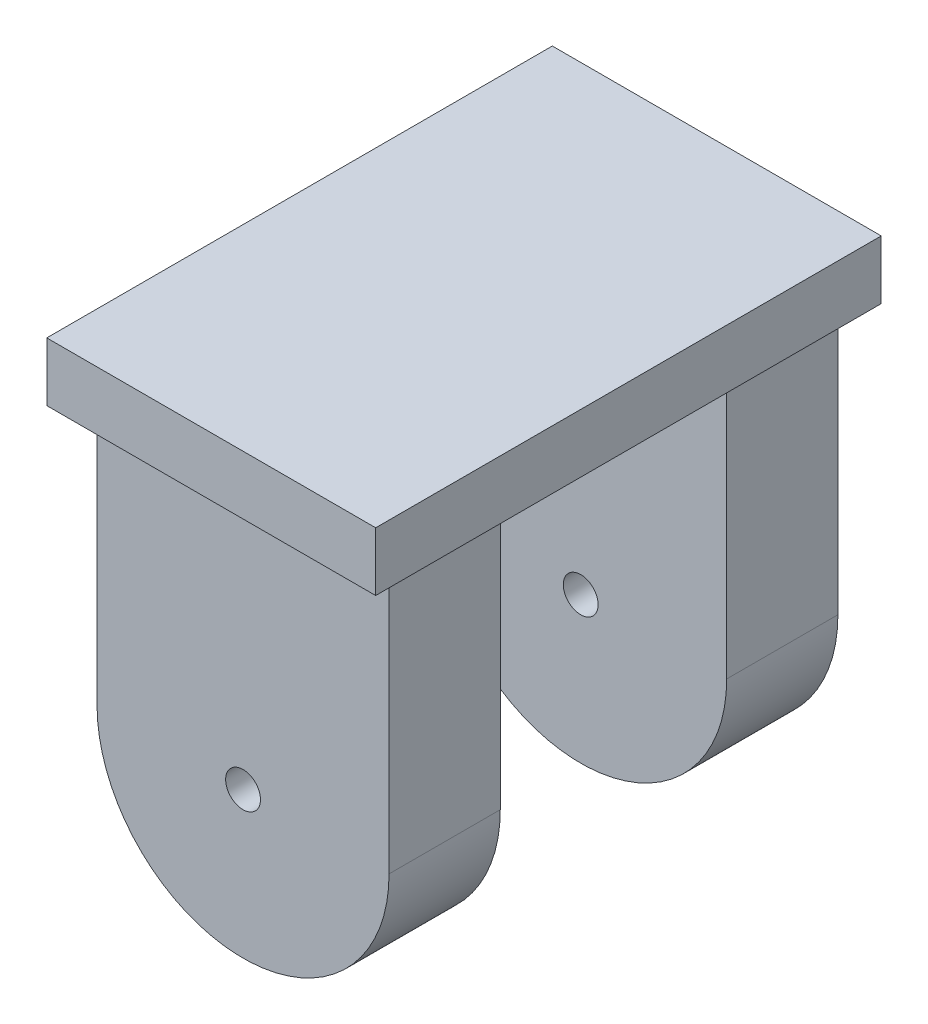
ISO-10303-21;
HEADER;
FILE_DESCRIPTION(('STEP AP214'),'2;1');
FILE_NAME('part.step','',(''),(''),'','','');
FILE_SCHEMA(('AUTOMOTIVE_DESIGN { 1 0 10303 214 1 1 1 1 }'));
ENDSEC;
DATA;
#1=APPLICATION_CONTEXT('core data for automotive mechanical design processes');
#2=APPLICATION_PROTOCOL_DEFINITION('international standard','automotive_design',2000,#1);
#3=PRODUCT_CONTEXT('',#1,'mechanical');
#4=PRODUCT('Part','Part','',(#3));
#5=PRODUCT_RELATED_PRODUCT_CATEGORY('part','',(#4));
#6=PRODUCT_DEFINITION_FORMATION('','',#4);
#7=PRODUCT_DEFINITION_CONTEXT('part definition',#1,'design');
#8=PRODUCT_DEFINITION('design','',#6,#7);
#9=PRODUCT_DEFINITION_SHAPE('','',#8);
#10=(LENGTH_UNIT() NAMED_UNIT(*) SI_UNIT(.MILLI.,.METRE.));
#11=(NAMED_UNIT(*) PLANE_ANGLE_UNIT() SI_UNIT($,.RADIAN.));
#12=(NAMED_UNIT(*) SI_UNIT($,.STERADIAN.) SOLID_ANGLE_UNIT());
#13=UNCERTAINTY_MEASURE_WITH_UNIT(LENGTH_MEASURE(1.E-05),#10,'distance_accuracy_value','');
#14=(GEOMETRIC_REPRESENTATION_CONTEXT(3) GLOBAL_UNCERTAINTY_ASSIGNED_CONTEXT((#13)) GLOBAL_UNIT_ASSIGNED_CONTEXT((#10,
#11,#12)) REPRESENTATION_CONTEXT('',''));
#15=CARTESIAN_POINT('',(0.,0.,0.));
#16=DIRECTION('',(0.,0.,1.));
#17=DIRECTION('',(1.,0.,0.));
#18=AXIS2_PLACEMENT_3D('',#15,#16,#17);
#19=CARTESIAN_POINT('',(20.4206380314162,31.4285452958827,64.4223527306653));
#20=DIRECTION('',(0.,0.,-1.));
#21=DIRECTION('',(-1.,0.,0.));
#22=AXIS2_PLACEMENT_3D('',#19,#20,#21);
#23=CYLINDRICAL_SURFACE('',#22,41.9130289227795);
#24=CARTESIAN_POINT('',(20.4206380314162,31.4285452958827,-32.5));
#25=DIRECTION('',(0.,0.,1.));
#26=DIRECTION('',(1.,0.,0.));
#27=AXIS2_PLACEMENT_3D('',#24,#25,#26);
#28=CIRCLE('',#27,41.9130289227795);
#29=CARTESIAN_POINT('',(-21.4923908913633,31.4285452958827,-32.5));
#30=VERTEX_POINT('',#29);
#31=CARTESIAN_POINT('',(62.3336669541957,31.4285452958827,-32.5));
#32=VERTEX_POINT('',#31);
#33=EDGE_CURVE('E253',#30,#32,#28,.T.);
#34=ORIENTED_EDGE('',*,*,#33,.F.);
#35=DIRECTION('',(0.,0.,-1.));
#36=VECTOR('',#35,1.);
#37=CARTESIAN_POINT('',(-21.4923908913633,31.4285452958827,64.4223527306653));
#38=LINE('',#37,#36);
#39=CARTESIAN_POINT('',(-21.4923908913633,31.4285452958827,-64.4223527306653));
#40=VERTEX_POINT('',#39);
#41=EDGE_CURVE('E89',#30,#40,#38,.T.);
#42=ORIENTED_EDGE('',*,*,#41,.T.);
#43=CARTESIAN_POINT('',(20.4206380314162,31.4285452958827,-64.4223527306653));
#44=DIRECTION('',(0.,0.,1.));
#45=DIRECTION('',(1.,0.,0.));
#46=AXIS2_PLACEMENT_3D('',#43,#44,#45);
#47=CIRCLE('',#46,41.9130289227795);
#48=CARTESIAN_POINT('',(62.3336669541957,31.4285452958827,-64.4223527306653));
#49=VERTEX_POINT('',#48);
#50=EDGE_CURVE('E190',#40,#49,#47,.T.);
#51=ORIENTED_EDGE('',*,*,#50,.T.);
#52=DIRECTION('',(0.,0.,-1.));
#53=VECTOR('',#52,1.);
#54=CARTESIAN_POINT('',(62.3336669541957,31.4285452958827,64.4223527306653));
#55=LINE('',#54,#53);
#56=EDGE_CURVE('E54',#32,#49,#55,.T.);
#57=ORIENTED_EDGE('',*,*,#56,.F.);
#58=EDGE_LOOP('',(#34,#42,#51,#57));
#59=FACE_BOUND('',#58,.T.);
#60=ADVANCED_FACE('F45',(#59),#23,.T.);
#61=CARTESIAN_POINT('',(62.3336669541957,31.4285452958827,64.4223527306653));
#62=DIRECTION('',(-1.,0.,0.));
#63=DIRECTION('',(0.,0.,1.));
#64=AXIS2_PLACEMENT_3D('',#61,#62,#63);
#65=PLANE('',#64);
#66=DIRECTION('',(0.,1.,0.));
#67=VECTOR('',#66,1.);
#68=CARTESIAN_POINT('',(62.3336669541957,31.4285452958827,-32.5));
#69=LINE('',#68,#67);
#70=CARTESIAN_POINT('',(62.3336669541956,107.442049888343,-32.5));
#71=VERTEX_POINT('',#70);
#72=EDGE_CURVE('E239',#32,#71,#69,.T.);
#73=ORIENTED_EDGE('',*,*,#72,.F.);
#74=ORIENTED_EDGE('',*,*,#56,.T.);
#75=DIRECTION('',(0.,1.,0.));
#76=VECTOR('',#75,1.);
#77=CARTESIAN_POINT('',(62.3336669541957,31.4285452958827,-64.4223527306653));
#78=LINE('',#77,#76);
#79=CARTESIAN_POINT('',(62.3336669541957,107.442049888343,-64.4223527306653));
#80=VERTEX_POINT('',#79);
#81=EDGE_CURVE('E186',#49,#80,#78,.T.);
#82=ORIENTED_EDGE('',*,*,#81,.T.);
#83=DIRECTION('',(0.,0.,-1.));
#84=VECTOR('',#83,1.);
#85=CARTESIAN_POINT('',(62.3336669541957,107.442049888343,64.4223527306653));
#86=LINE('',#85,#84);
#87=EDGE_CURVE('E166',#71,#80,#86,.T.);
#88=ORIENTED_EDGE('',*,*,#87,.F.);
#89=EDGE_LOOP('',(#73,#74,#82,#88));
#90=FACE_BOUND('',#89,.T.);
#91=ADVANCED_FACE('F291',(#90),#65,.F.);
#92=CARTESIAN_POINT('',(-21.4923908913633,31.4285452958827,64.4223527306653));
#93=DIRECTION('',(1.,0.,0.));
#94=DIRECTION('',(0.,0.,-1.));
#95=AXIS2_PLACEMENT_3D('',#92,#93,#94);
#96=PLANE('',#95);
#97=DIRECTION('',(0.,-1.,0.));
#98=VECTOR('',#97,1.);
#99=CARTESIAN_POINT('',(-21.4923908913633,31.4285452958827,-32.5));
#100=LINE('',#99,#98);
#101=CARTESIAN_POINT('',(-21.4923908913633,107.442049888343,-32.5));
#102=VERTEX_POINT('',#101);
#103=EDGE_CURVE('E256',#102,#30,#100,.T.);
#104=ORIENTED_EDGE('',*,*,#103,.F.);
#105=DIRECTION('',(0.,0.,-1.));
#106=VECTOR('',#105,1.);
#107=CARTESIAN_POINT('',(-21.4923908913633,107.442049888343,64.4223527306653));
#108=LINE('',#107,#106);
#109=CARTESIAN_POINT('',(-21.4923908913633,107.442049888343,-64.4223527306653));
#110=VERTEX_POINT('',#109);
#111=EDGE_CURVE('E173',#102,#110,#108,.T.);
#112=ORIENTED_EDGE('',*,*,#111,.T.);
#113=DIRECTION('',(0.,-1.,0.));
#114=VECTOR('',#113,1.);
#115=CARTESIAN_POINT('',(-21.4923908913633,31.4285452958827,-64.4223527306653));
#116=LINE('',#115,#114);
#117=EDGE_CURVE('E178',#110,#40,#116,.T.);
#118=ORIENTED_EDGE('',*,*,#117,.T.);
#119=ORIENTED_EDGE('',*,*,#41,.F.);
#120=EDGE_LOOP('',(#104,#112,#118,#119));
#121=FACE_BOUND('',#120,.T.);
#122=ADVANCED_FACE('F280',(#121),#96,.F.);
#123=CARTESIAN_POINT('',(20.4206380314162,31.4285452958827,64.4223527306653));
#124=DIRECTION('',(0.,0.,-1.));
#125=DIRECTION('',(-1.,0.,0.));
#126=AXIS2_PLACEMENT_3D('',#123,#124,#125);
#127=CYLINDRICAL_SURFACE('',#126,5.);
#128=CARTESIAN_POINT('',(20.4206380314162,31.4285452958827,-64.4223527306653));
#129=DIRECTION('',(0.,0.,1.));
#130=DIRECTION('',(1.,0.,0.));
#131=AXIS2_PLACEMENT_3D('',#128,#129,#130);
#132=CIRCLE('',#131,5.);
#133=CARTESIAN_POINT('',(25.4206380314162,31.4285452958827,-64.4223527306653));
#134=VERTEX_POINT('',#133);
#135=EDGE_CURVE('E202',#134,#134,#132,.T.);
#136=ORIENTED_EDGE('',*,*,#135,.F.);
#137=EDGE_LOOP('',(#136));
#138=FACE_BOUND('',#137,.T.);
#139=CARTESIAN_POINT('',(20.4206380314162,31.4285452958827,-32.5));
#140=DIRECTION('',(0.,0.,1.));
#141=DIRECTION('',(1.,0.,0.));
#142=AXIS2_PLACEMENT_3D('',#139,#140,#141);
#143=CIRCLE('',#142,5.);
#144=CARTESIAN_POINT('',(25.4206380314162,31.4285452958827,-32.5));
#145=VERTEX_POINT('',#144);
#146=EDGE_CURVE('E160',#145,#145,#143,.T.);
#147=ORIENTED_EDGE('',*,*,#146,.T.);
#148=EDGE_LOOP('',(#147));
#149=FACE_BOUND('',#148,.T.);
#150=ADVANCED_FACE('F319',(#138,#149),#127,.F.);
#151=CARTESIAN_POINT('',(20.4206380314162,31.4285452958827,64.4223527306653));
#152=DIRECTION('',(0.,0.,1.));
#153=DIRECTION('',(1.,0.,0.));
#154=AXIS2_PLACEMENT_3D('',#151,#152,#153);
#155=PLANE('',#154);
#156=CARTESIAN_POINT('',(20.4206380314162,31.4285452958827,64.4223527306653));
#157=DIRECTION('',(0.,0.,1.));
#158=DIRECTION('',(1.,0.,0.));
#159=AXIS2_PLACEMENT_3D('',#156,#157,#158);
#160=CIRCLE('',#159,41.9130289227795);
#161=CARTESIAN_POINT('',(-21.4923908913633,31.4285452958827,64.4223527306653));
#162=VERTEX_POINT('',#161);
#163=CARTESIAN_POINT('',(62.3336669541957,31.4285452958827,64.4223527306653));
#164=VERTEX_POINT('',#163);
#165=EDGE_CURVE('E181',#162,#164,#160,.T.);
#166=ORIENTED_EDGE('',*,*,#165,.T.);
#167=DIRECTION('',(0.,1.,0.));
#168=VECTOR('',#167,1.);
#169=CARTESIAN_POINT('',(62.3336669541957,31.4285452958827,64.4223527306653));
#170=LINE('',#169,#168);
#171=CARTESIAN_POINT('',(62.3336669541957,107.442049888343,64.4223527306653));
#172=VERTEX_POINT('',#171);
#173=EDGE_CURVE('E96',#164,#172,#170,.T.);
#174=ORIENTED_EDGE('',*,*,#173,.T.);
#175=DIRECTION('',(-1.,0.,0.));
#176=VECTOR('',#175,1.);
#177=CARTESIAN_POINT('',(-21.4923908913633,107.442049888343,64.4223527306653));
#178=LINE('',#177,#176);
#179=CARTESIAN_POINT('',(-21.4923908913633,107.442049888343,64.4223527306653));
#180=VERTEX_POINT('',#179);
#181=EDGE_CURVE('E164',#172,#180,#178,.T.);
#182=ORIENTED_EDGE('',*,*,#181,.T.);
#183=DIRECTION('',(0.,-1.,0.));
#184=VECTOR('',#183,1.);
#185=CARTESIAN_POINT('',(-21.4923908913633,31.4285452958827,64.4223527306653));
#186=LINE('',#185,#184);
#187=EDGE_CURVE('E70',#180,#162,#186,.T.);
#188=ORIENTED_EDGE('',*,*,#187,.T.);
#189=EDGE_LOOP('',(#166,#174,#182,#188));
#190=FACE_BOUND('',#189,.T.);
#191=CARTESIAN_POINT('',(20.4206380314162,31.4285452958827,64.4223527306653));
#192=DIRECTION('',(0.,0.,1.));
#193=DIRECTION('',(1.,0.,0.));
#194=AXIS2_PLACEMENT_3D('',#191,#192,#193);
#195=CIRCLE('',#194,5.);
#196=CARTESIAN_POINT('',(25.4206380314162,31.4285452958827,64.4223527306653));
#197=VERTEX_POINT('',#196);
#198=EDGE_CURVE('E193',#197,#197,#195,.T.);
#199=ORIENTED_EDGE('',*,*,#198,.F.);
#200=EDGE_LOOP('',(#199));
#201=FACE_BOUND('',#200,.T.);
#202=ADVANCED_FACE('F306',(#190,#201),#155,.T.);
#203=CARTESIAN_POINT('',(20.4206380314162,31.4285452958827,-64.4223527306653));
#204=DIRECTION('',(0.,0.,1.));
#205=DIRECTION('',(1.,0.,0.));
#206=AXIS2_PLACEMENT_3D('',#203,#204,#205);
#207=PLANE('',#206);
#208=ORIENTED_EDGE('',*,*,#50,.F.);
#209=ORIENTED_EDGE('',*,*,#117,.F.);
#210=DIRECTION('',(-1.,0.,0.));
#211=VECTOR('',#210,1.);
#212=CARTESIAN_POINT('',(-21.4923908913633,107.442049888343,-64.4223527306653));
#213=LINE('',#212,#211);
#214=EDGE_CURVE('E182',#80,#110,#213,.T.);
#215=ORIENTED_EDGE('',*,*,#214,.F.);
#216=ORIENTED_EDGE('',*,*,#81,.F.);
#217=EDGE_LOOP('',(#208,#209,#215,#216));
#218=FACE_BOUND('',#217,.T.);
#219=ORIENTED_EDGE('',*,*,#135,.T.);
#220=EDGE_LOOP('',(#219));
#221=FACE_BOUND('',#220,.T.);
#222=ADVANCED_FACE('F288',(#218,#221),#207,.F.);
#223=CARTESIAN_POINT('',(-21.4923908913633,31.4285452958827,32.5));
#224=VERTEX_POINT('',#223);
#225=EDGE_CURVE('E174',#162,#224,#38,.T.);
#226=ORIENTED_EDGE('',*,*,#225,.T.);
#227=CARTESIAN_POINT('',(20.4206380314162,31.4285452958827,32.5));
#228=DIRECTION('',(0.,0.,1.));
#229=DIRECTION('',(1.,0.,0.));
#230=AXIS2_PLACEMENT_3D('',#227,#228,#229);
#231=CIRCLE('',#230,41.9130289227795);
#232=CARTESIAN_POINT('',(62.3336669541957,31.4285452958827,32.5));
#233=VERTEX_POINT('',#232);
#234=EDGE_CURVE('E61',#224,#233,#231,.T.);
#235=ORIENTED_EDGE('',*,*,#234,.T.);
#236=EDGE_CURVE('E11',#164,#233,#55,.T.);
#237=ORIENTED_EDGE('',*,*,#236,.F.);
#238=ORIENTED_EDGE('',*,*,#165,.F.);
#239=EDGE_LOOP('',(#226,#235,#237,#238));
#240=FACE_BOUND('',#239,.T.);
#241=ADVANCED_FACE('F47',(#240),#23,.T.);
#242=ORIENTED_EDGE('',*,*,#236,.T.);
#243=DIRECTION('',(0.,1.,0.));
#244=VECTOR('',#243,1.);
#245=CARTESIAN_POINT('',(62.3336669541957,31.4285452958827,32.5));
#246=LINE('',#245,#244);
#247=CARTESIAN_POINT('',(62.3336669541956,107.442049888343,32.5));
#248=VERTEX_POINT('',#247);
#249=EDGE_CURVE('E146',#233,#248,#246,.T.);
#250=ORIENTED_EDGE('',*,*,#249,.T.);
#251=EDGE_CURVE('E156',#172,#248,#86,.T.);
#252=ORIENTED_EDGE('',*,*,#251,.F.);
#253=ORIENTED_EDGE('',*,*,#173,.F.);
#254=EDGE_LOOP('',(#242,#250,#252,#253));
#255=FACE_BOUND('',#254,.T.);
#256=ADVANCED_FACE('F155',(#255),#65,.F.);
#257=CARTESIAN_POINT('',(-21.4923908913633,107.442049888343,32.5));
#258=VERTEX_POINT('',#257);
#259=EDGE_CURVE('E169',#180,#258,#108,.T.);
#260=ORIENTED_EDGE('',*,*,#259,.T.);
#261=DIRECTION('',(0.,-1.,0.));
#262=VECTOR('',#261,1.);
#263=CARTESIAN_POINT('',(-21.4923908913633,31.4285452958827,32.5));
#264=LINE('',#263,#262);
#265=EDGE_CURVE('E147',#258,#224,#264,.T.);
#266=ORIENTED_EDGE('',*,*,#265,.T.);
#267=ORIENTED_EDGE('',*,*,#225,.F.);
#268=ORIENTED_EDGE('',*,*,#187,.F.);
#269=EDGE_LOOP('',(#260,#266,#267,#268));
#270=FACE_BOUND('',#269,.T.);
#271=ADVANCED_FACE('F304',(#270),#96,.F.);
#272=CARTESIAN_POINT('',(20.4206380314162,31.4285452958827,32.5));
#273=DIRECTION('',(0.,0.,1.));
#274=DIRECTION('',(1.,0.,0.));
#275=AXIS2_PLACEMENT_3D('',#272,#273,#274);
#276=CIRCLE('',#275,5.);
#277=CARTESIAN_POINT('',(25.4206380314162,31.4285452958827,32.5));
#278=VERTEX_POINT('',#277);
#279=EDGE_CURVE('E266',#278,#278,#276,.T.);
#280=ORIENTED_EDGE('',*,*,#279,.F.);
#281=EDGE_LOOP('',(#280));
#282=FACE_BOUND('',#281,.T.);
#283=ORIENTED_EDGE('',*,*,#198,.T.);
#284=EDGE_LOOP('',(#283));
#285=FACE_BOUND('',#284,.T.);
#286=ADVANCED_FACE('F311',(#282,#285),#127,.F.);
#287=CARTESIAN_POINT('',(-27.1789980660796,124.286755349674,73.1629430116794));
#288=DIRECTION('',(1.,0.,0.));
#289=DIRECTION('',(0.,0.,-1.));
#290=AXIS2_PLACEMENT_3D('',#287,#288,#289);
#291=PLANE('',#290);
#292=DIRECTION('',(0.,0.,1.));
#293=VECTOR('',#292,1.);
#294=CARTESIAN_POINT('',(-27.1789980660796,107.442049888343,73.1629430116794));
#295=LINE('',#294,#293);
#296=CARTESIAN_POINT('',(-27.1789980660796,107.442049888343,-71.9533067417381));
#297=VERTEX_POINT('',#296);
#298=CARTESIAN_POINT('',(-27.1789980660796,107.442049888343,73.1629430116794));
#299=VERTEX_POINT('',#298);
#300=EDGE_CURVE('E236',#297,#299,#295,.T.);
#301=ORIENTED_EDGE('',*,*,#300,.T.);
#302=DIRECTION('',(0.,-1.,0.));
#303=VECTOR('',#302,1.);
#304=CARTESIAN_POINT('',(-27.1789980660796,124.286755349674,73.1629430116794));
#305=LINE('',#304,#303);
#306=CARTESIAN_POINT('',(-27.1789980660796,124.286755349674,73.1629430116794));
#307=VERTEX_POINT('',#306);
#308=EDGE_CURVE('E206',#307,#299,#305,.T.);
#309=ORIENTED_EDGE('',*,*,#308,.F.);
#310=DIRECTION('',(0.,0.,1.));
#311=VECTOR('',#310,1.);
#312=CARTESIAN_POINT('',(-27.1789980660796,124.286755349674,73.1629430116794));
#313=LINE('',#312,#311);
#314=CARTESIAN_POINT('',(-27.1789980660796,124.286755349674,-71.9533067417381));
#315=VERTEX_POINT('',#314);
#316=EDGE_CURVE('E229',#315,#307,#313,.T.);
#317=ORIENTED_EDGE('',*,*,#316,.F.);
#318=DIRECTION('',(0.,-1.,0.));
#319=VECTOR('',#318,1.);
#320=CARTESIAN_POINT('',(-27.1789980660796,124.286755349674,-71.9533067417381));
#321=LINE('',#320,#319);
#322=EDGE_CURVE('E221',#315,#297,#321,.T.);
#323=ORIENTED_EDGE('',*,*,#322,.T.);
#324=EDGE_LOOP('',(#301,#309,#317,#323));
#325=FACE_BOUND('',#324,.T.);
#326=ADVANCED_FACE('F316',(#325),#291,.F.);
#327=CARTESIAN_POINT('',(-27.1789980660796,124.286755349674,73.1629430116794));
#328=DIRECTION('',(0.,0.,-1.));
#329=DIRECTION('',(-1.,0.,0.));
#330=AXIS2_PLACEMENT_3D('',#327,#328,#329);
#331=PLANE('',#330);
#332=DIRECTION('',(1.,0.,0.));
#333=VECTOR('',#332,1.);
#334=CARTESIAN_POINT('',(-27.1789980660796,107.442049888343,73.1629430116794));
#335=LINE('',#334,#333);
#336=CARTESIAN_POINT('',(67.2332876588578,107.442049888343,73.1629430116794));
#337=VERTEX_POINT('',#336);
#338=EDGE_CURVE('E233',#299,#337,#335,.T.);
#339=ORIENTED_EDGE('',*,*,#338,.T.);
#340=DIRECTION('',(0.,-1.,0.));
#341=VECTOR('',#340,1.);
#342=CARTESIAN_POINT('',(67.2332876588578,124.286755349674,73.1629430116794));
#343=LINE('',#342,#341);
#344=CARTESIAN_POINT('',(67.2332876588578,124.286755349674,73.1629430116794));
#345=VERTEX_POINT('',#344);
#346=EDGE_CURVE('E213',#345,#337,#343,.T.);
#347=ORIENTED_EDGE('',*,*,#346,.F.);
#348=DIRECTION('',(1.,0.,0.));
#349=VECTOR('',#348,1.);
#350=CARTESIAN_POINT('',(-27.1789980660796,124.286755349674,73.1629430116794));
#351=LINE('',#350,#349);
#352=EDGE_CURVE('E245',#307,#345,#351,.T.);
#353=ORIENTED_EDGE('',*,*,#352,.F.);
#354=ORIENTED_EDGE('',*,*,#308,.T.);
#355=EDGE_LOOP('',(#339,#347,#353,#354));
#356=FACE_BOUND('',#355,.T.);
#357=ADVANCED_FACE('F333',(#356),#331,.F.);
#358=CARTESIAN_POINT('',(67.2332876588578,124.286755349674,73.1629430116794));
#359=DIRECTION('',(-1.,0.,0.));
#360=DIRECTION('',(0.,0.,1.));
#361=AXIS2_PLACEMENT_3D('',#358,#359,#360);
#362=PLANE('',#361);
#363=DIRECTION('',(0.,0.,-1.));
#364=VECTOR('',#363,1.);
#365=CARTESIAN_POINT('',(67.2332876588578,107.442049888343,73.1629430116794));
#366=LINE('',#365,#364);
#367=CARTESIAN_POINT('',(67.2332876588578,107.442049888343,-71.9533067417381));
#368=VERTEX_POINT('',#367);
#369=EDGE_CURVE('E230',#337,#368,#366,.T.);
#370=ORIENTED_EDGE('',*,*,#369,.T.);
#371=DIRECTION('',(0.,-1.,0.));
#372=VECTOR('',#371,1.);
#373=CARTESIAN_POINT('',(67.2332876588578,124.286755349674,-71.9533067417381));
#374=LINE('',#373,#372);
#375=CARTESIAN_POINT('',(67.2332876588578,124.286755349674,-71.9533067417381));
#376=VERTEX_POINT('',#375);
#377=EDGE_CURVE('E217',#376,#368,#374,.T.);
#378=ORIENTED_EDGE('',*,*,#377,.F.);
#379=DIRECTION('',(0.,0.,-1.));
#380=VECTOR('',#379,1.);
#381=CARTESIAN_POINT('',(67.2332876588578,124.286755349674,73.1629430116794));
#382=LINE('',#381,#380);
#383=EDGE_CURVE('E242',#345,#376,#382,.T.);
#384=ORIENTED_EDGE('',*,*,#383,.F.);
#385=ORIENTED_EDGE('',*,*,#346,.T.);
#386=EDGE_LOOP('',(#370,#378,#384,#385));
#387=FACE_BOUND('',#386,.T.);
#388=ADVANCED_FACE('F337',(#387),#362,.F.);
#389=CARTESIAN_POINT('',(-27.1789980660796,124.286755349674,-71.9533067417381));
#390=DIRECTION('',(0.,0.,1.));
#391=DIRECTION('',(1.,0.,0.));
#392=AXIS2_PLACEMENT_3D('',#389,#390,#391);
#393=PLANE('',#392);
#394=DIRECTION('',(-1.,0.,0.));
#395=VECTOR('',#394,1.);
#396=CARTESIAN_POINT('',(-27.1789980660796,107.442049888343,-71.9533067417381));
#397=LINE('',#396,#395);
#398=EDGE_CURVE('E226',#368,#297,#397,.T.);
#399=ORIENTED_EDGE('',*,*,#398,.T.);
#400=ORIENTED_EDGE('',*,*,#322,.F.);
#401=DIRECTION('',(-1.,0.,0.));
#402=VECTOR('',#401,1.);
#403=CARTESIAN_POINT('',(-27.1789980660796,124.286755349674,-71.9533067417381));
#404=LINE('',#403,#402);
#405=EDGE_CURVE('E225',#376,#315,#404,.T.);
#406=ORIENTED_EDGE('',*,*,#405,.F.);
#407=ORIENTED_EDGE('',*,*,#377,.T.);
#408=EDGE_LOOP('',(#399,#400,#406,#407));
#409=FACE_BOUND('',#408,.T.);
#410=ADVANCED_FACE('F341',(#409),#393,.F.);
#411=CARTESIAN_POINT('',(0.,124.286755349674,0.));
#412=DIRECTION('',(0.,-1.,0.));
#413=DIRECTION('',(0.,0.,-1.));
#414=AXIS2_PLACEMENT_3D('',#411,#412,#413);
#415=PLANE('',#414);
#416=ORIENTED_EDGE('',*,*,#316,.T.);
#417=ORIENTED_EDGE('',*,*,#352,.T.);
#418=ORIENTED_EDGE('',*,*,#383,.T.);
#419=ORIENTED_EDGE('',*,*,#405,.T.);
#420=EDGE_LOOP('',(#416,#417,#418,#419));
#421=FACE_BOUND('',#420,.T.);
#422=ADVANCED_FACE('F345',(#421),#415,.F.);
#423=CARTESIAN_POINT('',(0.,107.442049888343,0.));
#424=DIRECTION('',(0.,-1.,0.));
#425=DIRECTION('',(0.,0.,-1.));
#426=AXIS2_PLACEMENT_3D('',#423,#424,#425);
#427=PLANE('',#426);
#428=DIRECTION('',(-1.,0.,0.));
#429=VECTOR('',#428,1.);
#430=CARTESIAN_POINT('',(-32.3568437221294,107.442049888343,-32.5));
#431=LINE('',#430,#429);
#432=EDGE_CURVE('E153',#71,#102,#431,.T.);
#433=ORIENTED_EDGE('',*,*,#432,.F.);
#434=ORIENTED_EDGE('',*,*,#87,.T.);
#435=ORIENTED_EDGE('',*,*,#214,.T.);
#436=ORIENTED_EDGE('',*,*,#111,.F.);
#437=EDGE_LOOP('',(#433,#434,#435,#436));
#438=FACE_BOUND('',#437,.T.);
#439=ORIENTED_EDGE('',*,*,#251,.T.);
#440=DIRECTION('',(-1.,0.,0.));
#441=VECTOR('',#440,1.);
#442=CARTESIAN_POINT('',(-32.3568437221294,107.442049888343,32.5));
#443=LINE('',#442,#441);
#444=EDGE_CURVE('E143',#248,#258,#443,.T.);
#445=ORIENTED_EDGE('',*,*,#444,.T.);
#446=ORIENTED_EDGE('',*,*,#259,.F.);
#447=ORIENTED_EDGE('',*,*,#181,.F.);
#448=EDGE_LOOP('',(#439,#445,#446,#447));
#449=FACE_BOUND('',#448,.T.);
#450=ORIENTED_EDGE('',*,*,#398,.F.);
#451=ORIENTED_EDGE('',*,*,#369,.F.);
#452=ORIENTED_EDGE('',*,*,#338,.F.);
#453=ORIENTED_EDGE('',*,*,#300,.F.);
#454=EDGE_LOOP('',(#450,#451,#452,#453));
#455=FACE_BOUND('',#454,.T.);
#456=ADVANCED_FACE('F162',(#438,#449,#455),#427,.T.);
#457=CARTESIAN_POINT('',(0.,0.,-32.5));
#458=DIRECTION('',(0.,0.,1.));
#459=DIRECTION('',(1.,0.,0.));
#460=AXIS2_PLACEMENT_3D('',#457,#458,#459);
#461=PLANE('',#460);
#462=ORIENTED_EDGE('',*,*,#146,.F.);
#463=EDGE_LOOP('',(#462));
#464=FACE_BOUND('',#463,.T.);
#465=ORIENTED_EDGE('',*,*,#72,.T.);
#466=ORIENTED_EDGE('',*,*,#432,.T.);
#467=ORIENTED_EDGE('',*,*,#103,.T.);
#468=ORIENTED_EDGE('',*,*,#33,.T.);
#469=EDGE_LOOP('',(#465,#466,#467,#468));
#470=FACE_BOUND('',#469,.T.);
#471=ADVANCED_FACE('F274',(#464,#470),#461,.T.);
#472=CARTESIAN_POINT('',(0.,0.,32.5));
#473=DIRECTION('',(0.,0.,1.));
#474=DIRECTION('',(1.,0.,0.));
#475=AXIS2_PLACEMENT_3D('',#472,#473,#474);
#476=PLANE('',#475);
#477=ORIENTED_EDGE('',*,*,#279,.T.);
#478=EDGE_LOOP('',(#477));
#479=FACE_BOUND('',#478,.T.);
#480=ORIENTED_EDGE('',*,*,#234,.F.);
#481=ORIENTED_EDGE('',*,*,#265,.F.);
#482=ORIENTED_EDGE('',*,*,#444,.F.);
#483=ORIENTED_EDGE('',*,*,#249,.F.);
#484=EDGE_LOOP('',(#480,#481,#482,#483));
#485=FACE_BOUND('',#484,.T.);
#486=ADVANCED_FACE('F145',(#479,#485),#476,.F.);
#487=CLOSED_SHELL('',(#60,#91,#122,#150,#202,#222,#241,#256,#271,#286,#326,#357,#388,#410,#422,
#456,#471,#486));
#488=MANIFOLD_SOLID_BREP('B2',#487);
#489=ADVANCED_BREP_SHAPE_REPRESENTATION('',(#18,#488),#14);
#490=SHAPE_DEFINITION_REPRESENTATION(#9,#489);
ENDSEC;
END-ISO-10303-21;
